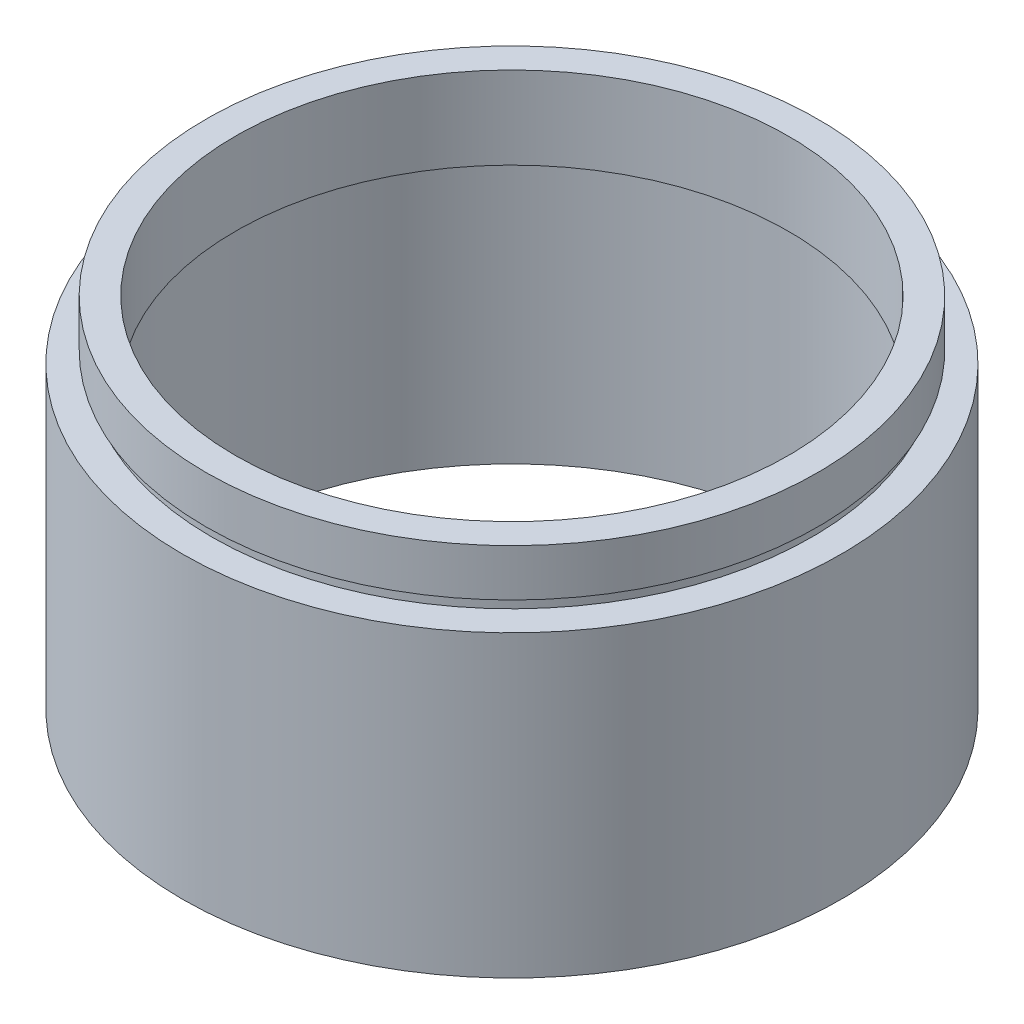
ISO-10303-21;
HEADER;
FILE_DESCRIPTION(('STEP AP214'),'2;1');
FILE_NAME('part.step','',(''),(''),'','','');
FILE_SCHEMA(('AUTOMOTIVE_DESIGN { 1 0 10303 214 1 1 1 1 }'));
ENDSEC;
DATA;
#1=APPLICATION_CONTEXT('core data for automotive mechanical design processes');
#2=APPLICATION_PROTOCOL_DEFINITION('international standard','automotive_design',2000,#1);
#3=PRODUCT_CONTEXT('',#1,'mechanical');
#4=PRODUCT('Part','Part','',(#3));
#5=PRODUCT_RELATED_PRODUCT_CATEGORY('part','',(#4));
#6=PRODUCT_DEFINITION_FORMATION('','',#4);
#7=PRODUCT_DEFINITION_CONTEXT('part definition',#1,'design');
#8=PRODUCT_DEFINITION('design','',#6,#7);
#9=PRODUCT_DEFINITION_SHAPE('','',#8);
#10=(LENGTH_UNIT() NAMED_UNIT(*) SI_UNIT(.MILLI.,.METRE.));
#11=(NAMED_UNIT(*) PLANE_ANGLE_UNIT() SI_UNIT($,.RADIAN.));
#12=(NAMED_UNIT(*) SI_UNIT($,.STERADIAN.) SOLID_ANGLE_UNIT());
#13=UNCERTAINTY_MEASURE_WITH_UNIT(LENGTH_MEASURE(1.E-05),#10,'distance_accuracy_value','');
#14=(GEOMETRIC_REPRESENTATION_CONTEXT(3) GLOBAL_UNCERTAINTY_ASSIGNED_CONTEXT((#13)) GLOBAL_UNIT_ASSIGNED_CONTEXT((#10,
#11,#12)) REPRESENTATION_CONTEXT('',''));
#15=CARTESIAN_POINT('',(0.,0.,0.));
#16=DIRECTION('',(0.,0.,1.));
#17=DIRECTION('',(1.,0.,0.));
#18=AXIS2_PLACEMENT_3D('',#15,#16,#17);
#19=CARTESIAN_POINT('',(0.,161.376166943427,0.));
#20=DIRECTION('',(0.,1.,0.));
#21=DIRECTION('',(0.,0.,1.));
#22=AXIS2_PLACEMENT_3D('',#19,#20,#21);
#23=CYLINDRICAL_SURFACE('',#22,23.5);
#24=CARTESIAN_POINT('',(0.,23.4,0.));
#25=DIRECTION('',(0.,1.,0.));
#26=DIRECTION('',(0.,0.,1.));
#27=AXIS2_PLACEMENT_3D('',#24,#25,#26);
#28=CIRCLE('',#27,23.5);
#29=CARTESIAN_POINT('',(0.,23.4,23.5));
#30=VERTEX_POINT('',#29);
#31=EDGE_CURVE('E77',#30,#30,#28,.T.);
#32=ORIENTED_EDGE('',*,*,#31,.F.);
#33=EDGE_LOOP('',(#32));
#34=FACE_BOUND('',#33,.T.);
#35=CARTESIAN_POINT('',(0.,30.4,0.));
#36=DIRECTION('',(0.,1.,0.));
#37=DIRECTION('',(0.,0.,1.));
#38=AXIS2_PLACEMENT_3D('',#35,#36,#37);
#39=CIRCLE('',#38,23.5);
#40=CARTESIAN_POINT('',(0.,30.4,23.5));
#41=VERTEX_POINT('',#40);
#42=EDGE_CURVE('E10',#41,#41,#39,.T.);
#43=ORIENTED_EDGE('',*,*,#42,.T.);
#44=EDGE_LOOP('',(#43));
#45=FACE_BOUND('',#44,.T.);
#46=ADVANCED_FACE('F37',(#34,#45),#23,.F.);
#47=CARTESIAN_POINT('',(23.5,30.4,0.));
#48=DIRECTION('',(0.,-1.,0.));
#49=DIRECTION('',(0.,0.,-1.));
#50=AXIS2_PLACEMENT_3D('',#47,#48,#49);
#51=PLANE('',#50);
#52=ORIENTED_EDGE('',*,*,#42,.F.);
#53=EDGE_LOOP('',(#52));
#54=FACE_BOUND('',#53,.T.);
#55=CARTESIAN_POINT('',(0.,30.4,0.));
#56=DIRECTION('',(0.,1.,0.));
#57=DIRECTION('',(0.,0.,1.));
#58=AXIS2_PLACEMENT_3D('',#55,#56,#57);
#59=CIRCLE('',#58,26.);
#60=CARTESIAN_POINT('',(0.,30.4,26.));
#61=VERTEX_POINT('',#60);
#62=EDGE_CURVE('E43',#61,#61,#59,.T.);
#63=ORIENTED_EDGE('',*,*,#62,.T.);
#64=EDGE_LOOP('',(#63));
#65=FACE_BOUND('',#64,.T.);
#66=ADVANCED_FACE('F84',(#54,#65),#51,.F.);
#67=CARTESIAN_POINT('',(0.,161.376166943427,0.));
#68=DIRECTION('',(0.,1.,0.));
#69=DIRECTION('',(0.,0.,1.));
#70=AXIS2_PLACEMENT_3D('',#67,#68,#69);
#71=CYLINDRICAL_SURFACE('',#70,26.);
#72=ORIENTED_EDGE('',*,*,#62,.F.);
#73=EDGE_LOOP('',(#72));
#74=FACE_BOUND('',#73,.T.);
#75=CARTESIAN_POINT('',(0.,26.4,0.));
#76=DIRECTION('',(0.,1.,0.));
#77=DIRECTION('',(0.,0.,1.));
#78=AXIS2_PLACEMENT_3D('',#75,#76,#77);
#79=CIRCLE('',#78,26.);
#80=CARTESIAN_POINT('',(0.,26.4,26.));
#81=VERTEX_POINT('',#80);
#82=EDGE_CURVE('E47',#81,#81,#79,.T.);
#83=ORIENTED_EDGE('',*,*,#82,.T.);
#84=EDGE_LOOP('',(#83));
#85=FACE_BOUND('',#84,.T.);
#86=ADVANCED_FACE('F88',(#74,#85),#71,.T.);
#87=CARTESIAN_POINT('',(26.,26.4,0.));
#88=DIRECTION('',(0.,1.,0.));
#89=DIRECTION('',(0.,0.,1.));
#90=AXIS2_PLACEMENT_3D('',#87,#88,#89);
#91=PLANE('',#90);
#92=ORIENTED_EDGE('',*,*,#82,.F.);
#93=EDGE_LOOP('',(#92));
#94=FACE_BOUND('',#93,.T.);
#95=CARTESIAN_POINT('',(0.,26.4,0.));
#96=DIRECTION('',(0.,1.,0.));
#97=DIRECTION('',(0.,0.,1.));
#98=AXIS2_PLACEMENT_3D('',#95,#96,#97);
#99=CIRCLE('',#98,25.5);
#100=CARTESIAN_POINT('',(0.,26.4,25.5));
#101=VERTEX_POINT('',#100);
#102=EDGE_CURVE('E51',#101,#101,#99,.T.);
#103=ORIENTED_EDGE('',*,*,#102,.T.);
#104=EDGE_LOOP('',(#103));
#105=FACE_BOUND('',#104,.T.);
#106=ADVANCED_FACE('F93',(#94,#105),#91,.F.);
#107=CARTESIAN_POINT('',(0.,161.376166943427,0.));
#108=DIRECTION('',(0.,1.,0.));
#109=DIRECTION('',(0.,0.,1.));
#110=AXIS2_PLACEMENT_3D('',#107,#108,#109);
#111=CYLINDRICAL_SURFACE('',#110,25.5);
#112=ORIENTED_EDGE('',*,*,#102,.F.);
#113=EDGE_LOOP('',(#112));
#114=FACE_BOUND('',#113,.T.);
#115=CARTESIAN_POINT('',(0.,25.4,0.));
#116=DIRECTION('',(0.,1.,0.));
#117=DIRECTION('',(0.,0.,1.));
#118=AXIS2_PLACEMENT_3D('',#115,#116,#117);
#119=CIRCLE('',#118,25.5);
#120=CARTESIAN_POINT('',(0.,25.4,25.5));
#121=VERTEX_POINT('',#120);
#122=EDGE_CURVE('E56',#121,#121,#119,.T.);
#123=ORIENTED_EDGE('',*,*,#122,.T.);
#124=EDGE_LOOP('',(#123));
#125=FACE_BOUND('',#124,.T.);
#126=ADVANCED_FACE('F99',(#114,#125),#111,.T.);
#127=CARTESIAN_POINT('',(25.5,25.4,0.));
#128=DIRECTION('',(0.,-1.,0.));
#129=DIRECTION('',(0.,0.,-1.));
#130=AXIS2_PLACEMENT_3D('',#127,#128,#129);
#131=PLANE('',#130);
#132=ORIENTED_EDGE('',*,*,#122,.F.);
#133=EDGE_LOOP('',(#132));
#134=FACE_BOUND('',#133,.T.);
#135=CARTESIAN_POINT('',(0.,25.4,0.));
#136=DIRECTION('',(0.,1.,0.));
#137=DIRECTION('',(0.,0.,1.));
#138=AXIS2_PLACEMENT_3D('',#135,#136,#137);
#139=CIRCLE('',#138,28.);
#140=CARTESIAN_POINT('',(0.,25.4,28.));
#141=VERTEX_POINT('',#140);
#142=EDGE_CURVE('E59',#141,#141,#139,.T.);
#143=ORIENTED_EDGE('',*,*,#142,.T.);
#144=EDGE_LOOP('',(#143));
#145=FACE_BOUND('',#144,.T.);
#146=ADVANCED_FACE('F103',(#134,#145),#131,.F.);
#147=CARTESIAN_POINT('',(0.,161.376166943427,0.));
#148=DIRECTION('',(0.,1.,0.));
#149=DIRECTION('',(0.,0.,1.));
#150=AXIS2_PLACEMENT_3D('',#147,#148,#149);
#151=CYLINDRICAL_SURFACE('',#150,28.);
#152=ORIENTED_EDGE('',*,*,#142,.F.);
#153=EDGE_LOOP('',(#152));
#154=FACE_BOUND('',#153,.T.);
#155=CARTESIAN_POINT('',(0.,0.,0.));
#156=DIRECTION('',(0.,1.,0.));
#157=DIRECTION('',(0.,0.,1.));
#158=AXIS2_PLACEMENT_3D('',#155,#156,#157);
#159=CIRCLE('',#158,28.);
#160=CARTESIAN_POINT('',(0.,0.,28.));
#161=VERTEX_POINT('',#160);
#162=EDGE_CURVE('E62',#161,#161,#159,.T.);
#163=ORIENTED_EDGE('',*,*,#162,.T.);
#164=EDGE_LOOP('',(#163));
#165=FACE_BOUND('',#164,.T.);
#166=ADVANCED_FACE('F107',(#154,#165),#151,.T.);
#167=CARTESIAN_POINT('',(28.,0.,0.));
#168=DIRECTION('',(0.,1.,0.));
#169=DIRECTION('',(0.,0.,1.));
#170=AXIS2_PLACEMENT_3D('',#167,#168,#169);
#171=PLANE('',#170);
#172=ORIENTED_EDGE('',*,*,#162,.F.);
#173=EDGE_LOOP('',(#172));
#174=FACE_BOUND('',#173,.T.);
#175=CARTESIAN_POINT('',(0.,0.,0.));
#176=DIRECTION('',(0.,1.,0.));
#177=DIRECTION('',(0.,0.,1.));
#178=AXIS2_PLACEMENT_3D('',#175,#176,#177);
#179=CIRCLE('',#178,25.5);
#180=CARTESIAN_POINT('',(0.,0.,25.5));
#181=VERTEX_POINT('',#180);
#182=EDGE_CURVE('E65',#181,#181,#179,.T.);
#183=ORIENTED_EDGE('',*,*,#182,.T.);
#184=EDGE_LOOP('',(#183));
#185=FACE_BOUND('',#184,.T.);
#186=ADVANCED_FACE('F111',(#174,#185),#171,.F.);
#187=CARTESIAN_POINT('',(0.,161.376166943427,0.));
#188=DIRECTION('',(0.,1.,0.));
#189=DIRECTION('',(0.,0.,1.));
#190=AXIS2_PLACEMENT_3D('',#187,#188,#189);
#191=CYLINDRICAL_SURFACE('',#190,25.5);
#192=ORIENTED_EDGE('',*,*,#182,.F.);
#193=EDGE_LOOP('',(#192));
#194=FACE_BOUND('',#193,.T.);
#195=CARTESIAN_POINT('',(0.,22.4,0.));
#196=DIRECTION('',(0.,1.,0.));
#197=DIRECTION('',(0.,0.,1.));
#198=AXIS2_PLACEMENT_3D('',#195,#196,#197);
#199=CIRCLE('',#198,25.5);
#200=CARTESIAN_POINT('',(0.,22.4,25.5));
#201=VERTEX_POINT('',#200);
#202=EDGE_CURVE('E68',#201,#201,#199,.T.);
#203=ORIENTED_EDGE('',*,*,#202,.T.);
#204=EDGE_LOOP('',(#203));
#205=FACE_BOUND('',#204,.T.);
#206=ADVANCED_FACE('F115',(#194,#205),#191,.F.);
#207=CARTESIAN_POINT('',(25.5,22.4,0.));
#208=DIRECTION('',(0.,-1.,0.));
#209=DIRECTION('',(0.,0.,-1.));
#210=AXIS2_PLACEMENT_3D('',#207,#208,#209);
#211=PLANE('',#210);
#212=ORIENTED_EDGE('',*,*,#202,.F.);
#213=EDGE_LOOP('',(#212));
#214=FACE_BOUND('',#213,.T.);
#215=CARTESIAN_POINT('',(0.,22.4,0.));
#216=DIRECTION('',(0.,1.,0.));
#217=DIRECTION('',(0.,0.,1.));
#218=AXIS2_PLACEMENT_3D('',#215,#216,#217);
#219=CIRCLE('',#218,26.1);
#220=CARTESIAN_POINT('',(0.,22.4,26.1));
#221=VERTEX_POINT('',#220);
#222=EDGE_CURVE('E71',#221,#221,#219,.T.);
#223=ORIENTED_EDGE('',*,*,#222,.T.);
#224=EDGE_LOOP('',(#223));
#225=FACE_BOUND('',#224,.T.);
#226=ADVANCED_FACE('F119',(#214,#225),#211,.F.);
#227=CARTESIAN_POINT('',(0.,161.376166943427,0.));
#228=DIRECTION('',(0.,1.,0.));
#229=DIRECTION('',(0.,0.,1.));
#230=AXIS2_PLACEMENT_3D('',#227,#228,#229);
#231=CYLINDRICAL_SURFACE('',#230,26.1);
#232=ORIENTED_EDGE('',*,*,#222,.F.);
#233=EDGE_LOOP('',(#232));
#234=FACE_BOUND('',#233,.T.);
#235=CARTESIAN_POINT('',(0.,23.4,0.));
#236=DIRECTION('',(0.,1.,0.));
#237=DIRECTION('',(0.,0.,1.));
#238=AXIS2_PLACEMENT_3D('',#235,#236,#237);
#239=CIRCLE('',#238,26.1);
#240=CARTESIAN_POINT('',(0.,23.4,26.1));
#241=VERTEX_POINT('',#240);
#242=EDGE_CURVE('E74',#241,#241,#239,.T.);
#243=ORIENTED_EDGE('',*,*,#242,.T.);
#244=EDGE_LOOP('',(#243));
#245=FACE_BOUND('',#244,.T.);
#246=ADVANCED_FACE('F123',(#234,#245),#231,.F.);
#247=CARTESIAN_POINT('',(26.1,23.4,0.));
#248=DIRECTION('',(0.,1.,0.));
#249=DIRECTION('',(0.,0.,1.));
#250=AXIS2_PLACEMENT_3D('',#247,#248,#249);
#251=PLANE('',#250);
#252=ORIENTED_EDGE('',*,*,#242,.F.);
#253=EDGE_LOOP('',(#252));
#254=FACE_BOUND('',#253,.T.);
#255=ORIENTED_EDGE('',*,*,#31,.T.);
#256=EDGE_LOOP('',(#255));
#257=FACE_BOUND('',#256,.T.);
#258=ADVANCED_FACE('F81',(#254,#257),#251,.F.);
#259=CLOSED_SHELL('',(#46,#66,#86,#106,#126,#146,#166,#186,#206,#226,#246,#258));
#260=MANIFOLD_SOLID_BREP('B2',#259);
#261=ADVANCED_BREP_SHAPE_REPRESENTATION('',(#18,#260),#14);
#262=SHAPE_DEFINITION_REPRESENTATION(#9,#261);
ENDSEC;
END-ISO-10303-21;
